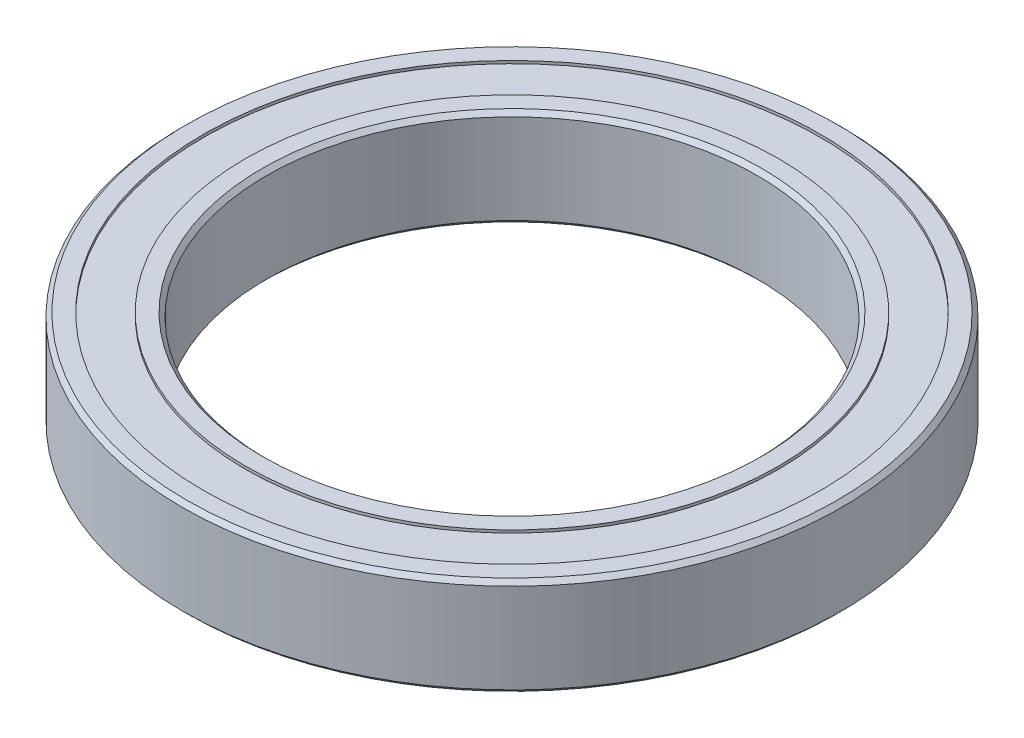
ISO-10303-21;
HEADER;
FILE_DESCRIPTION(('STEP AP214'),'2;1');
FILE_NAME('part.step','',(''),(''),'','','');
FILE_SCHEMA(('AUTOMOTIVE_DESIGN { 1 0 10303 214 1 1 1 1 }'));
ENDSEC;
DATA;
#1=APPLICATION_CONTEXT('core data for automotive mechanical design processes');
#2=APPLICATION_PROTOCOL_DEFINITION('international standard','automotive_design',2000,#1);
#3=PRODUCT_CONTEXT('',#1,'mechanical');
#4=PRODUCT('Part','Part','',(#3));
#5=PRODUCT_RELATED_PRODUCT_CATEGORY('part','',(#4));
#6=PRODUCT_DEFINITION_FORMATION('','',#4);
#7=PRODUCT_DEFINITION_CONTEXT('part definition',#1,'design');
#8=PRODUCT_DEFINITION('design','',#6,#7);
#9=PRODUCT_DEFINITION_SHAPE('','',#8);
#10=(LENGTH_UNIT() NAMED_UNIT(*) SI_UNIT(.MILLI.,.METRE.));
#11=(NAMED_UNIT(*) PLANE_ANGLE_UNIT() SI_UNIT($,.RADIAN.));
#12=(NAMED_UNIT(*) SI_UNIT($,.STERADIAN.) SOLID_ANGLE_UNIT());
#13=UNCERTAINTY_MEASURE_WITH_UNIT(LENGTH_MEASURE(1.E-05),#10,'distance_accuracy_value','');
#14=(GEOMETRIC_REPRESENTATION_CONTEXT(3) GLOBAL_UNCERTAINTY_ASSIGNED_CONTEXT((#13)) GLOBAL_UNIT_ASSIGNED_CONTEXT((#10,
#11,#12)) REPRESENTATION_CONTEXT('',''));
#15=CARTESIAN_POINT('',(0.,0.,0.));
#16=DIRECTION('',(0.,0.,1.));
#17=DIRECTION('',(1.,0.,0.));
#18=AXIS2_PLACEMENT_3D('',#15,#16,#17);
#19=CARTESIAN_POINT('',(0.,0.,0.));
#20=DIRECTION('',(0.,1.,0.));
#21=DIRECTION('',(0.,0.,1.));
#22=AXIS2_PLACEMENT_3D('',#19,#20,#21);
#23=PLANE('',#22);
#24=CARTESIAN_POINT('',(0.,0.,0.));
#25=DIRECTION('',(0.,1.,0.));
#26=DIRECTION('',(0.,0.,1.));
#27=AXIS2_PLACEMENT_3D('',#24,#25,#26);
#28=CIRCLE('',#27,17.8);
#29=CARTESIAN_POINT('',(0.,0.,17.8));
#30=VERTEX_POINT('',#29);
#31=EDGE_CURVE('E58',#30,#30,#28,.T.);
#32=ORIENTED_EDGE('',*,*,#31,.T.);
#33=EDGE_LOOP('',(#32));
#34=FACE_BOUND('',#33,.T.);
#35=CARTESIAN_POINT('',(0.,0.,0.));
#36=DIRECTION('',(0.,-1.,0.));
#37=DIRECTION('',(0.,0.,-1.));
#38=AXIS2_PLACEMENT_3D('',#35,#36,#37);
#39=CIRCLE('',#38,19.);
#40=CARTESIAN_POINT('',(0.,0.,-19.));
#41=VERTEX_POINT('',#40);
#42=EDGE_CURVE('E86',#41,#41,#39,.T.);
#43=ORIENTED_EDGE('',*,*,#42,.T.);
#44=EDGE_LOOP('',(#43));
#45=FACE_BOUND('',#44,.T.);
#46=ADVANCED_FACE('F34',(#34,#45),#23,.F.);
#47=CARTESIAN_POINT('',(0.,7.,0.));
#48=DIRECTION('',(0.,1.,0.));
#49=DIRECTION('',(0.,0.,1.));
#50=AXIS2_PLACEMENT_3D('',#47,#48,#49);
#51=PLANE('',#50);
#52=CARTESIAN_POINT('',(0.,7.,0.));
#53=DIRECTION('',(0.,1.,0.));
#54=DIRECTION('',(0.,0.,1.));
#55=AXIS2_PLACEMENT_3D('',#52,#53,#54);
#56=CIRCLE('',#55,17.8);
#57=CARTESIAN_POINT('',(0.,7.,17.8));
#58=VERTEX_POINT('',#57);
#59=EDGE_CURVE('E10',#58,#58,#56,.F.);
#60=ORIENTED_EDGE('',*,*,#59,.T.);
#61=EDGE_LOOP('',(#60));
#62=FACE_BOUND('',#61,.T.);
#63=CARTESIAN_POINT('',(0.,7.,0.));
#64=DIRECTION('',(0.,1.,0.));
#65=DIRECTION('',(0.,0.,1.));
#66=AXIS2_PLACEMENT_3D('',#63,#64,#65);
#67=CIRCLE('',#66,19.);
#68=CARTESIAN_POINT('',(0.,7.,19.));
#69=VERTEX_POINT('',#68);
#70=EDGE_CURVE('E74',#69,#69,#67,.T.);
#71=ORIENTED_EDGE('',*,*,#70,.T.);
#72=EDGE_LOOP('',(#71));
#73=FACE_BOUND('',#72,.T.);
#74=ADVANCED_FACE('F137',(#62,#73),#51,.T.);
#75=CARTESIAN_POINT('',(0.,7.,0.));
#76=DIRECTION('',(0.,1.,0.));
#77=DIRECTION('',(0.,0.,1.));
#78=AXIS2_PLACEMENT_3D('',#75,#76,#77);
#79=CIRCLE('',#78,23.2);
#80=CARTESIAN_POINT('',(0.,7.,23.2));
#81=VERTEX_POINT('',#80);
#82=EDGE_CURVE('E50',#81,#81,#79,.T.);
#83=ORIENTED_EDGE('',*,*,#82,.T.);
#84=EDGE_LOOP('',(#83));
#85=FACE_BOUND('',#84,.T.);
#86=CARTESIAN_POINT('',(0.,7.,0.));
#87=DIRECTION('',(0.,1.,0.));
#88=DIRECTION('',(0.,0.,1.));
#89=AXIS2_PLACEMENT_3D('',#86,#87,#88);
#90=CIRCLE('',#89,22.);
#91=CARTESIAN_POINT('',(0.,7.,22.));
#92=VERTEX_POINT('',#91);
#93=EDGE_CURVE('E68',#92,#92,#90,.T.);
#94=ORIENTED_EDGE('',*,*,#93,.F.);
#95=EDGE_LOOP('',(#94));
#96=FACE_BOUND('',#95,.T.);
#97=ADVANCED_FACE('F111',(#85,#96),#51,.T.);
#98=CARTESIAN_POINT('',(0.,0.,0.));
#99=DIRECTION('',(0.,-1.,0.));
#100=DIRECTION('',(0.,0.,-1.));
#101=AXIS2_PLACEMENT_3D('',#98,#99,#100);
#102=CIRCLE('',#101,22.);
#103=CARTESIAN_POINT('',(0.,0.,-22.));
#104=VERTEX_POINT('',#103);
#105=EDGE_CURVE('E80',#104,#104,#102,.T.);
#106=ORIENTED_EDGE('',*,*,#105,.F.);
#107=EDGE_LOOP('',(#106));
#108=FACE_BOUND('',#107,.T.);
#109=CARTESIAN_POINT('',(0.,0.,0.));
#110=DIRECTION('',(0.,1.,0.));
#111=DIRECTION('',(0.,0.,1.));
#112=AXIS2_PLACEMENT_3D('',#109,#110,#111);
#113=CIRCLE('',#112,23.2);
#114=CARTESIAN_POINT('',(0.,0.,23.2));
#115=VERTEX_POINT('',#114);
#116=EDGE_CURVE('E55',#115,#115,#113,.F.);
#117=ORIENTED_EDGE('',*,*,#116,.T.);
#118=EDGE_LOOP('',(#117));
#119=FACE_BOUND('',#118,.T.);
#120=ADVANCED_FACE('F107',(#108,#119),#23,.F.);
#121=CARTESIAN_POINT('',(0.,7.,0.));
#122=DIRECTION('',(0.,-1.,0.));
#123=DIRECTION('',(0.,0.,-1.));
#124=AXIS2_PLACEMENT_3D('',#121,#122,#123);
#125=CYLINDRICAL_SURFACE('',#124,23.5);
#126=CARTESIAN_POINT('',(0.,0.300000000000002,0.));
#127=DIRECTION('',(0.,1.,0.));
#128=DIRECTION('',(0.,0.,1.));
#129=AXIS2_PLACEMENT_3D('',#126,#127,#128);
#130=CIRCLE('',#129,23.5);
#131=CARTESIAN_POINT('',(0.,0.300000000000002,23.5));
#132=VERTEX_POINT('',#131);
#133=EDGE_CURVE('E61',#132,#132,#130,.T.);
#134=ORIENTED_EDGE('',*,*,#133,.T.);
#135=EDGE_LOOP('',(#134));
#136=FACE_BOUND('',#135,.T.);
#137=CARTESIAN_POINT('',(0.,6.69999999999999,0.));
#138=DIRECTION('',(0.,1.,0.));
#139=DIRECTION('',(0.,0.,1.));
#140=AXIS2_PLACEMENT_3D('',#137,#138,#139);
#141=CIRCLE('',#140,23.5);
#142=CARTESIAN_POINT('',(0.,6.69999999999999,23.5));
#143=VERTEX_POINT('',#142);
#144=EDGE_CURVE('E64',#143,#143,#141,.F.);
#145=ORIENTED_EDGE('',*,*,#144,.T.);
#146=EDGE_LOOP('',(#145));
#147=FACE_BOUND('',#146,.T.);
#148=ADVANCED_FACE('F110',(#136,#147),#125,.T.);
#149=CARTESIAN_POINT('',(0.,7.,0.));
#150=DIRECTION('',(0.,-1.,0.));
#151=DIRECTION('',(0.,0.,-1.));
#152=AXIS2_PLACEMENT_3D('',#149,#150,#151);
#153=CYLINDRICAL_SURFACE('',#152,17.5);
#154=CARTESIAN_POINT('',(0.,0.299999999999998,0.));
#155=DIRECTION('',(0.,1.,0.));
#156=DIRECTION('',(0.,0.,1.));
#157=AXIS2_PLACEMENT_3D('',#154,#155,#156);
#158=CIRCLE('',#157,17.5);
#159=CARTESIAN_POINT('',(0.,0.299999999999998,17.5));
#160=VERTEX_POINT('',#159);
#161=EDGE_CURVE('E42',#160,#160,#158,.F.);
#162=ORIENTED_EDGE('',*,*,#161,.T.);
#163=EDGE_LOOP('',(#162));
#164=FACE_BOUND('',#163,.T.);
#165=CARTESIAN_POINT('',(0.,6.70000000000001,0.));
#166=DIRECTION('',(0.,1.,0.));
#167=DIRECTION('',(0.,0.,1.));
#168=AXIS2_PLACEMENT_3D('',#165,#166,#167);
#169=CIRCLE('',#168,17.5);
#170=CARTESIAN_POINT('',(0.,6.70000000000001,17.5));
#171=VERTEX_POINT('',#170);
#172=EDGE_CURVE('E46',#171,#171,#169,.T.);
#173=ORIENTED_EDGE('',*,*,#172,.T.);
#174=EDGE_LOOP('',(#173));
#175=FACE_BOUND('',#174,.T.);
#176=ADVANCED_FACE('F125',(#164,#175),#153,.F.);
#177=CARTESIAN_POINT('',(0.,6.8,0.));
#178=DIRECTION('',(0.,1.,0.));
#179=DIRECTION('',(0.,0.,1.));
#180=AXIS2_PLACEMENT_3D('',#177,#178,#179);
#181=CYLINDRICAL_SURFACE('',#180,22.);
#182=CARTESIAN_POINT('',(0.,6.8,0.));
#183=DIRECTION('',(0.,1.,0.));
#184=DIRECTION('',(0.,0.,1.));
#185=AXIS2_PLACEMENT_3D('',#182,#183,#184);
#186=CIRCLE('',#185,22.);
#187=CARTESIAN_POINT('',(0.,6.8,22.));
#188=VERTEX_POINT('',#187);
#189=EDGE_CURVE('E67',#188,#188,#186,.T.);
#190=ORIENTED_EDGE('',*,*,#189,.F.);
#191=EDGE_LOOP('',(#190));
#192=FACE_BOUND('',#191,.T.);
#193=ORIENTED_EDGE('',*,*,#93,.T.);
#194=EDGE_LOOP('',(#193));
#195=FACE_BOUND('',#194,.T.);
#196=ADVANCED_FACE('F141',(#192,#195),#181,.F.);
#197=CARTESIAN_POINT('',(0.,6.8,0.));
#198=DIRECTION('',(0.,1.,0.));
#199=DIRECTION('',(0.,0.,1.));
#200=AXIS2_PLACEMENT_3D('',#197,#198,#199);
#201=PLANE('',#200);
#202=CARTESIAN_POINT('',(0.,6.8,0.));
#203=DIRECTION('',(0.,1.,0.));
#204=DIRECTION('',(0.,0.,1.));
#205=AXIS2_PLACEMENT_3D('',#202,#203,#204);
#206=CIRCLE('',#205,19.);
#207=CARTESIAN_POINT('',(0.,6.8,19.));
#208=VERTEX_POINT('',#207);
#209=EDGE_CURVE('E71',#208,#208,#206,.T.);
#210=ORIENTED_EDGE('',*,*,#209,.F.);
#211=EDGE_LOOP('',(#210));
#212=FACE_BOUND('',#211,.T.);
#213=ORIENTED_EDGE('',*,*,#189,.T.);
#214=EDGE_LOOP('',(#213));
#215=FACE_BOUND('',#214,.T.);
#216=ADVANCED_FACE('F143',(#212,#215),#201,.T.);
#217=CARTESIAN_POINT('',(0.,6.8,0.));
#218=DIRECTION('',(0.,1.,0.));
#219=DIRECTION('',(0.,0.,1.));
#220=AXIS2_PLACEMENT_3D('',#217,#218,#219);
#221=CYLINDRICAL_SURFACE('',#220,19.);
#222=ORIENTED_EDGE('',*,*,#209,.T.);
#223=EDGE_LOOP('',(#222));
#224=FACE_BOUND('',#223,.T.);
#225=ORIENTED_EDGE('',*,*,#70,.F.);
#226=EDGE_LOOP('',(#225));
#227=FACE_BOUND('',#226,.T.);
#228=ADVANCED_FACE('F119',(#224,#227),#221,.T.);
#229=CARTESIAN_POINT('',(0.,0.300000000000002,0.));
#230=DIRECTION('',(0.,1.,0.));
#231=DIRECTION('',(0.,0.,1.));
#232=AXIS2_PLACEMENT_3D('',#229,#230,#231);
#233=CONICAL_SURFACE('',#232,23.5,0.785398163397448);
#234=ORIENTED_EDGE('',*,*,#116,.F.);
#235=EDGE_LOOP('',(#234));
#236=FACE_BOUND('',#235,.T.);
#237=ORIENTED_EDGE('',*,*,#133,.F.);
#238=EDGE_LOOP('',(#237));
#239=FACE_BOUND('',#238,.T.);
#240=ADVANCED_FACE('F115',(#236,#239),#233,.T.);
#241=CARTESIAN_POINT('',(0.,7.,0.));
#242=DIRECTION('',(0.,-1.,0.));
#243=DIRECTION('',(0.,0.,-1.));
#244=AXIS2_PLACEMENT_3D('',#241,#242,#243);
#245=CONICAL_SURFACE('',#244,23.2,0.785398163397448);
#246=ORIENTED_EDGE('',*,*,#144,.F.);
#247=EDGE_LOOP('',(#246));
#248=FACE_BOUND('',#247,.T.);
#249=ORIENTED_EDGE('',*,*,#82,.F.);
#250=EDGE_LOOP('',(#249));
#251=FACE_BOUND('',#250,.T.);
#252=ADVANCED_FACE('F118',(#248,#251),#245,.T.);
#253=CARTESIAN_POINT('',(0.,0.,0.));
#254=DIRECTION('',(0.,-1.,0.));
#255=DIRECTION('',(0.,0.,-1.));
#256=AXIS2_PLACEMENT_3D('',#253,#254,#255);
#257=CONICAL_SURFACE('',#256,17.8,0.785398163397454);
#258=ORIENTED_EDGE('',*,*,#161,.F.);
#259=EDGE_LOOP('',(#258));
#260=FACE_BOUND('',#259,.T.);
#261=ORIENTED_EDGE('',*,*,#31,.F.);
#262=EDGE_LOOP('',(#261));
#263=FACE_BOUND('',#262,.T.);
#264=ADVANCED_FACE('F131',(#260,#263),#257,.F.);
#265=CARTESIAN_POINT('',(0.,6.70000000000001,0.));
#266=DIRECTION('',(0.,1.,0.));
#267=DIRECTION('',(0.,0.,1.));
#268=AXIS2_PLACEMENT_3D('',#265,#266,#267);
#269=CONICAL_SURFACE('',#268,17.5,0.785398163397466);
#270=ORIENTED_EDGE('',*,*,#59,.F.);
#271=EDGE_LOOP('',(#270));
#272=FACE_BOUND('',#271,.T.);
#273=ORIENTED_EDGE('',*,*,#172,.F.);
#274=EDGE_LOOP('',(#273));
#275=FACE_BOUND('',#274,.T.);
#276=ADVANCED_FACE('F37',(#272,#275),#269,.F.);
#277=CARTESIAN_POINT('',(0.,0.2,0.));
#278=DIRECTION('',(0.,-1.,0.));
#279=DIRECTION('',(0.,0.,-1.));
#280=AXIS2_PLACEMENT_3D('',#277,#278,#279);
#281=CYLINDRICAL_SURFACE('',#280,22.);
#282=CARTESIAN_POINT('',(0.,0.2,0.));
#283=DIRECTION('',(0.,-1.,0.));
#284=DIRECTION('',(0.,0.,-1.));
#285=AXIS2_PLACEMENT_3D('',#282,#283,#284);
#286=CIRCLE('',#285,22.);
#287=CARTESIAN_POINT('',(0.,0.2,-22.));
#288=VERTEX_POINT('',#287);
#289=EDGE_CURVE('E77',#288,#288,#286,.T.);
#290=ORIENTED_EDGE('',*,*,#289,.F.);
#291=EDGE_LOOP('',(#290));
#292=FACE_BOUND('',#291,.T.);
#293=ORIENTED_EDGE('',*,*,#105,.T.);
#294=EDGE_LOOP('',(#293));
#295=FACE_BOUND('',#294,.T.);
#296=ADVANCED_FACE('F98',(#292,#295),#281,.F.);
#297=CARTESIAN_POINT('',(0.,0.2,0.));
#298=DIRECTION('',(0.,-1.,0.));
#299=DIRECTION('',(0.,0.,-1.));
#300=AXIS2_PLACEMENT_3D('',#297,#298,#299);
#301=PLANE('',#300);
#302=CARTESIAN_POINT('',(0.,0.2,0.));
#303=DIRECTION('',(0.,-1.,0.));
#304=DIRECTION('',(0.,0.,-1.));
#305=AXIS2_PLACEMENT_3D('',#302,#303,#304);
#306=CIRCLE('',#305,19.);
#307=CARTESIAN_POINT('',(0.,0.2,-19.));
#308=VERTEX_POINT('',#307);
#309=EDGE_CURVE('E83',#308,#308,#306,.T.);
#310=ORIENTED_EDGE('',*,*,#309,.F.);
#311=EDGE_LOOP('',(#310));
#312=FACE_BOUND('',#311,.T.);
#313=ORIENTED_EDGE('',*,*,#289,.T.);
#314=EDGE_LOOP('',(#313));
#315=FACE_BOUND('',#314,.T.);
#316=ADVANCED_FACE('F95',(#312,#315),#301,.T.);
#317=CARTESIAN_POINT('',(0.,0.2,0.));
#318=DIRECTION('',(0.,-1.,0.));
#319=DIRECTION('',(0.,0.,-1.));
#320=AXIS2_PLACEMENT_3D('',#317,#318,#319);
#321=CYLINDRICAL_SURFACE('',#320,19.);
#322=ORIENTED_EDGE('',*,*,#309,.T.);
#323=EDGE_LOOP('',(#322));
#324=FACE_BOUND('',#323,.T.);
#325=ORIENTED_EDGE('',*,*,#42,.F.);
#326=EDGE_LOOP('',(#325));
#327=FACE_BOUND('',#326,.T.);
#328=ADVANCED_FACE('F92',(#324,#327),#321,.T.);
#329=CLOSED_SHELL('',(#46,#74,#97,#120,#148,#176,#196,#216,#228,#240,#252,#264,#276,#296,#316,#328));
#330=MANIFOLD_SOLID_BREP('B2',#329);
#331=ADVANCED_BREP_SHAPE_REPRESENTATION('',(#18,#330),#14);
#332=SHAPE_DEFINITION_REPRESENTATION(#9,#331);
ENDSEC;
END-ISO-10303-21;
